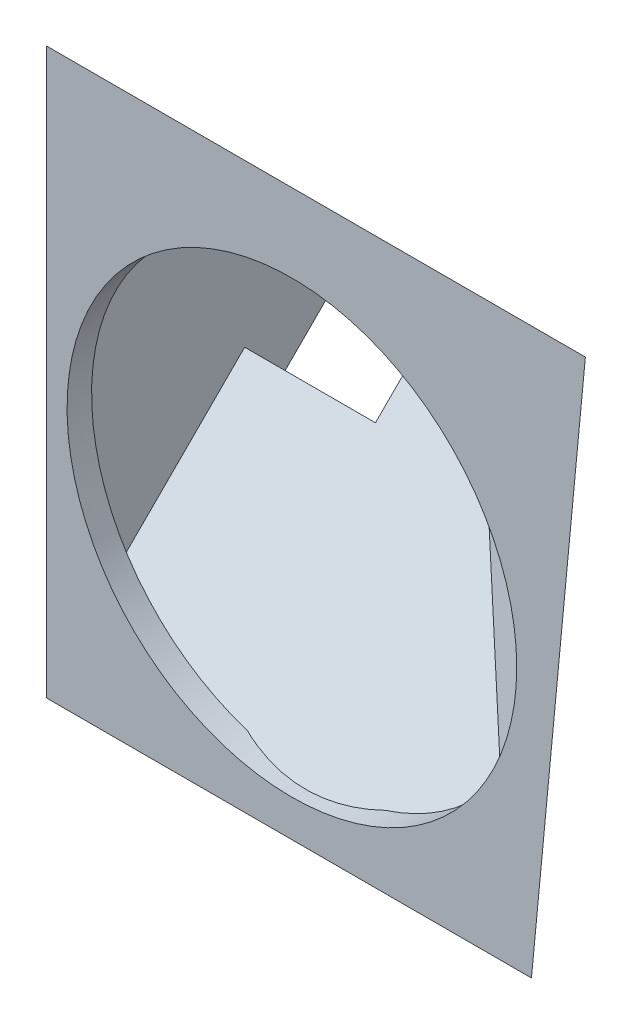
ISO-10303-21;
HEADER;
FILE_DESCRIPTION(('STEP AP214'),'2;1');
FILE_NAME('part.step','',(''),(''),'','','');
FILE_SCHEMA(('AUTOMOTIVE_DESIGN { 1 0 10303 214 1 1 1 1 }'));
ENDSEC;
DATA;
#1=APPLICATION_CONTEXT('core data for automotive mechanical design processes');
#2=APPLICATION_PROTOCOL_DEFINITION('international standard','automotive_design',2000,#1);
#3=PRODUCT_CONTEXT('',#1,'mechanical');
#4=PRODUCT('Part','Part','',(#3));
#5=PRODUCT_RELATED_PRODUCT_CATEGORY('part','',(#4));
#6=PRODUCT_DEFINITION_FORMATION('','',#4);
#7=PRODUCT_DEFINITION_CONTEXT('part definition',#1,'design');
#8=PRODUCT_DEFINITION('design','',#6,#7);
#9=PRODUCT_DEFINITION_SHAPE('','',#8);
#10=(LENGTH_UNIT() NAMED_UNIT(*) SI_UNIT(.MILLI.,.METRE.));
#11=(NAMED_UNIT(*) PLANE_ANGLE_UNIT() SI_UNIT($,.RADIAN.));
#12=(NAMED_UNIT(*) SI_UNIT($,.STERADIAN.) SOLID_ANGLE_UNIT());
#13=UNCERTAINTY_MEASURE_WITH_UNIT(LENGTH_MEASURE(1.E-05),#10,'distance_accuracy_value','');
#14=(GEOMETRIC_REPRESENTATION_CONTEXT(3) GLOBAL_UNCERTAINTY_ASSIGNED_CONTEXT((#13)) GLOBAL_UNIT_ASSIGNED_CONTEXT((#10,
#11,#12)) REPRESENTATION_CONTEXT('',''));
#15=CARTESIAN_POINT('',(0.,0.,0.));
#16=DIRECTION('',(0.,0.,1.));
#17=DIRECTION('',(1.,0.,0.));
#18=AXIS2_PLACEMENT_3D('',#15,#16,#17);
#19=CARTESIAN_POINT('',(-0.999999999999997,30.5355339059328,-32.5355339059329));
#20=DIRECTION('',(0.,-0.707106781186547,-0.707106781186547));
#21=DIRECTION('',(0.,0.707106781186548,-0.707106781186548));
#22=AXIS2_PLACEMENT_3D('',#19,#20,#21);
#23=PLANE('',#22);
#24=DIRECTION('',(-1.,0.,0.));
#25=VECTOR('',#24,1.);
#26=CARTESIAN_POINT('',(-2.,19.5753787975413,-21.5753787975413));
#27=LINE('',#26,#25);
#28=CARTESIAN_POINT('',(16.5,19.5753787975413,-21.5753787975413));
#29=VERTEX_POINT('',#28);
#30=CARTESIAN_POINT('',(-2.,19.5753787975413,-21.5753787975413));
#31=VERTEX_POINT('',#30);
#32=EDGE_CURVE('E262',#29,#31,#27,.T.);
#33=ORIENTED_EDGE('',*,*,#32,.F.);
#34=DIRECTION('',(0.,-0.707106781186548,0.707106781186548));
#35=VECTOR('',#34,1.);
#36=CARTESIAN_POINT('',(16.5,30.5355339059328,-32.5355339059329));
#37=LINE('',#36,#35);
#38=CARTESIAN_POINT('',(16.5,30.5355339059328,-32.5355339059329));
#39=VERTEX_POINT('',#38);
#40=EDGE_CURVE('E257',#39,#29,#37,.T.);
#41=ORIENTED_EDGE('',*,*,#40,.F.);
#42=DIRECTION('',(-1.,0.,0.));
#43=VECTOR('',#42,1.);
#44=CARTESIAN_POINT('',(-0.999999999999997,30.5355339059328,-32.5355339059329));
#45=LINE('',#44,#43);
#46=CARTESIAN_POINT('',(19.,30.5355339059329,-32.5355339059329));
#47=VERTEX_POINT('',#46);
#48=EDGE_CURVE('E420',#47,#39,#45,.T.);
#49=ORIENTED_EDGE('',*,*,#48,.F.);
#50=DIRECTION('',(0.,0.707106781186547,-0.707106781186548));
#51=VECTOR('',#50,1.);
#52=CARTESIAN_POINT('',(19.,30.5355339059329,-32.5355339059329));
#53=LINE('',#52,#51);
#54=CARTESIAN_POINT('',(19.,30.4660300272259,-32.4660300272259));
#55=VERTEX_POINT('',#54);
#56=EDGE_CURVE('E236',#55,#47,#53,.T.);
#57=ORIENTED_EDGE('',*,*,#56,.F.);
#58=DIRECTION('',(-0.920313974566673,-0.276606388408956,0.276606388408956));
#59=VECTOR('',#58,1.);
#60=CARTESIAN_POINT('',(50.9594752696427,40.0716594907398,-42.0716594907398));
#61=LINE('',#60,#59);
#62=CARTESIAN_POINT('',(19.0578126478103,30.4834059969026,-32.4834059969026));
#63=VERTEX_POINT('',#62);
#64=EDGE_CURVE('E359',#63,#55,#61,.T.);
#65=ORIENTED_EDGE('',*,*,#64,.F.);
#66=DIRECTION('',(-0.617093958453958,0.556414884074656,-0.556414884074656));
#67=VECTOR('',#66,1.);
#68=CARTESIAN_POINT('',(33.4208043364,17.5327325283206,-19.5327325283206));
#69=LINE('',#68,#67);
#70=CARTESIAN_POINT('',(57.3017599552091,-4.,2.));
#71=VERTEX_POINT('',#70);
#72=EDGE_CURVE('E361',#71,#63,#69,.T.);
#73=ORIENTED_EDGE('',*,*,#72,.F.);
#74=DIRECTION('',(1.,0.,0.));
#75=VECTOR('',#74,1.);
#76=CARTESIAN_POINT('',(0.,-4.,2.));
#77=LINE('',#76,#75);
#78=CARTESIAN_POINT('',(-1.99999999999999,-4.00000000000002,2.));
#79=VERTEX_POINT('',#78);
#80=EDGE_CURVE('E285',#79,#71,#77,.T.);
#81=ORIENTED_EDGE('',*,*,#80,.F.);
#82=DIRECTION('',(0.,-0.707106781186548,0.707106781186548));
#83=VECTOR('',#82,1.);
#84=CARTESIAN_POINT('',(-2.,30.5355339059328,-32.5355339059329));
#85=LINE('',#84,#83);
#86=EDGE_CURVE('E50',#31,#79,#85,.T.);
#87=ORIENTED_EDGE('',*,*,#86,.F.);
#88=EDGE_LOOP('',(#33,#41,#49,#57,#65,#73,#81,#87));
#89=FACE_BOUND('',#88,.T.);
#90=ADVANCED_FACE('F35',(#89),#23,.T.);
#91=CARTESIAN_POINT('',(-2.,58.,2.));
#92=DIRECTION('',(1.,0.,0.));
#93=DIRECTION('',(0.,1.,0.));
#94=AXIS2_PLACEMENT_3D('',#91,#92,#93);
#95=PLANE('',#94);
#96=DIRECTION('',(0.,-0.707106781186545,-0.70710678118655));
#97=VECTOR('',#96,1.);
#98=CARTESIAN_POINT('',(-2.,61.5355339059328,-1.53553390593273));
#99=LINE('',#98,#97);
#100=CARTESIAN_POINT('',(-2.,61.5355339059328,-1.53553390593273));
#101=VERTEX_POINT('',#100);
#102=CARTESIAN_POINT('',(-2.,27.0000000000001,-36.0710678118656));
#103=VERTEX_POINT('',#102);
#104=EDGE_CURVE('E416',#101,#103,#99,.T.);
#105=ORIENTED_EDGE('',*,*,#104,.T.);
#106=DIRECTION('',(0.,0.707106781186547,-0.707106781186547));
#107=VECTOR('',#106,1.);
#108=CARTESIAN_POINT('',(-2.,27.0000000000001,-36.0710678118656));
#109=LINE('',#108,#107);
#110=CARTESIAN_POINT('',(-2.,16.0398448916085,-25.110912703474));
#111=VERTEX_POINT('',#110);
#112=EDGE_CURVE('E258',#111,#103,#109,.T.);
#113=ORIENTED_EDGE('',*,*,#112,.F.);
#114=DIRECTION('',(0.,0.707106781186548,0.707106781186547));
#115=VECTOR('',#114,1.);
#116=CARTESIAN_POINT('',(-2.,16.0398448916085,-25.110912703474));
#117=LINE('',#116,#115);
#118=EDGE_CURVE('E268',#111,#31,#117,.T.);
#119=ORIENTED_EDGE('',*,*,#118,.T.);
#120=ORIENTED_EDGE('',*,*,#86,.T.);
#121=DIRECTION('',(0.,-1.,0.));
#122=VECTOR('',#121,1.);
#123=CARTESIAN_POINT('',(-1.99999999999999,0.,2.));
#124=LINE('',#123,#122);
#125=CARTESIAN_POINT('',(-2.,65.0710678118655,2.));
#126=VERTEX_POINT('',#125);
#127=EDGE_CURVE('E54',#126,#79,#124,.T.);
#128=ORIENTED_EDGE('',*,*,#127,.F.);
#129=DIRECTION('',(0.,0.707106781186545,0.70710678118655));
#130=VECTOR('',#129,1.);
#131=CARTESIAN_POINT('',(-2.,50.4320481590986,-12.639019652767));
#132=LINE('',#131,#130);
#133=CARTESIAN_POINT('',(-2.,62.0710678118655,-1.));
#134=VERTEX_POINT('',#133);
#135=EDGE_CURVE('E43',#134,#126,#132,.T.);
#136=ORIENTED_EDGE('',*,*,#135,.F.);
#137=DIRECTION('',(0.,-1.,0.));
#138=VECTOR('',#137,1.);
#139=CARTESIAN_POINT('',(-1.99999999999999,0.,-1.));
#140=LINE('',#139,#138);
#141=CARTESIAN_POINT('',(-2.,61.,-1.));
#142=VERTEX_POINT('',#141);
#143=EDGE_CURVE('E288',#134,#142,#140,.T.);
#144=ORIENTED_EDGE('',*,*,#143,.T.);
#145=DIRECTION('',(0.,0.70710678118655,-0.707106781186545));
#146=VECTOR('',#145,1.);
#147=CARTESIAN_POINT('',(-2.,58.,2.));
#148=LINE('',#147,#146);
#149=EDGE_CURVE('E412',#142,#101,#148,.T.);
#150=ORIENTED_EDGE('',*,*,#149,.T.);
#151=EDGE_LOOP('',(#105,#113,#119,#120,#128,#136,#144,#150));
#152=FACE_BOUND('',#151,.T.);
#153=ADVANCED_FACE('F37',(#152),#95,.F.);
#154=CARTESIAN_POINT('',(0.,0.,2.));
#155=DIRECTION('',(0.,0.,1.));
#156=DIRECTION('',(1.,0.,0.));
#157=AXIS2_PLACEMENT_3D('',#154,#155,#156);
#158=PLANE('',#157);
#159=ORIENTED_EDGE('',*,*,#127,.T.);
#160=ORIENTED_EDGE('',*,*,#80,.T.);
#161=DIRECTION('',(0.0950410018679323,0.995473358741428,0.));
#162=VECTOR('',#161,1.);
#163=CARTESIAN_POINT('',(57.1626082156239,-5.45749567930742,2.));
#164=LINE('',#163,#162);
#165=CARTESIAN_POINT('',(63.8961940777126,65.0710678118655,2.));
#166=VERTEX_POINT('',#165);
#167=EDGE_CURVE('E303',#71,#166,#164,.T.);
#168=ORIENTED_EDGE('',*,*,#167,.T.);
#169=DIRECTION('',(-1.,0.,0.));
#170=VECTOR('',#169,1.);
#171=CARTESIAN_POINT('',(0.,65.0710678118655,2.));
#172=LINE('',#171,#170);
#173=EDGE_CURVE('E294',#166,#126,#172,.T.);
#174=ORIENTED_EDGE('',*,*,#173,.T.);
#175=EDGE_LOOP('',(#159,#160,#168,#174));
#176=FACE_BOUND('',#175,.T.);
#177=CARTESIAN_POINT('',(28.,28.,2.));
#178=DIRECTION('',(0.,0.,1.));
#179=DIRECTION('',(1.,0.,0.));
#180=AXIS2_PLACEMENT_3D('',#177,#178,#179);
#181=CIRCLE('',#180,27.5);
#182=CARTESIAN_POINT('',(55.5,28.,2.));
#183=VERTEX_POINT('',#182);
#184=EDGE_CURVE('E423',#183,#183,#181,.T.);
#185=ORIENTED_EDGE('',*,*,#184,.F.);
#186=EDGE_LOOP('',(#185));
#187=FACE_BOUND('',#186,.T.);
#188=ADVANCED_FACE('F457',(#176,#187),#158,.T.);
#189=CARTESIAN_POINT('',(22.4693491883277,-2.14522009999242,-27.0649338448335));
#190=DIRECTION('',(0.637576713063338,-0.0608714728978925,-0.767978254084444));
#191=DIRECTION('',(-0.769405029139721,0.,-0.638761223881432));
#192=AXIS2_PLACEMENT_3D('',#189,#190,#191);
#193=PLANE('',#192);
#194=ORIENTED_EDGE('',*,*,#167,.F.);
#195=ORIENTED_EDGE('',*,*,#72,.T.);
#196=DIRECTION('',(0.676752968183959,0.520579206295352,0.520579206295355));
#197=VECTOR('',#196,1.);
#198=CARTESIAN_POINT('',(57.9982533790273,60.4375911747618,-2.52922081904323));
#199=LINE('',#198,#197);
#200=CARTESIAN_POINT('',(57.9982533790273,60.4375911747618,-2.52922081904323));
#201=VERTEX_POINT('',#200);
#202=EDGE_CURVE('E369',#63,#201,#199,.T.);
#203=ORIENTED_EDGE('',*,*,#202,.T.);
#204=DIRECTION('',(0.368105086916156,-0.851640742191297,0.37310412920029));
#205=VECTOR('',#204,1.);
#206=CARTESIAN_POINT('',(57.9982533790273,60.4375911747618,-2.52922081904323));
#207=LINE('',#206,#205);
#208=CARTESIAN_POINT('',(58.,60.4335502265806,-2.52745047812643));
#209=VERTEX_POINT('',#208);
#210=EDGE_CURVE('E366',#201,#209,#207,.T.);
#211=ORIENTED_EDGE('',*,*,#210,.T.);
#212=DIRECTION('',(0.,-0.996873493614738,0.0790141615683361));
#213=VECTOR('',#212,1.);
#214=CARTESIAN_POINT('',(58.,0.178221017418499,2.2485058974636));
#215=LINE('',#214,#213);
#216=CARTESIAN_POINT('',(58.,60.3617445062897,-2.52175901494585));
#217=VERTEX_POINT('',#216);
#218=EDGE_CURVE('E356',#209,#217,#215,.T.);
#219=ORIENTED_EDGE('',*,*,#218,.T.);
#220=DIRECTION('',(0.676638025521096,0.520845033743809,0.520462710713576));
#221=VECTOR('',#220,1.);
#222=CARTESIAN_POINT('',(11.0605112940198,24.2298709537277,-38.6271101923488));
#223=LINE('',#222,#221);
#224=CARTESIAN_POINT('',(59.9783934449024,61.8846213794527,-0.999999999999994));
#225=VERTEX_POINT('',#224);
#226=EDGE_CURVE('E305',#217,#225,#223,.T.);
#227=ORIENTED_EDGE('',*,*,#226,.T.);
#228=DIRECTION('',(0.0950410018679323,0.995473358741428,0.));
#229=VECTOR('',#228,1.);
#230=CARTESIAN_POINT('',(53.5816684606074,-5.11561199255989,-1.));
#231=LINE('',#230,#229);
#232=CARTESIAN_POINT('',(59.9961940777126,62.0710678118655,-1.));
#233=VERTEX_POINT('',#232);
#234=EDGE_CURVE('E300',#225,#233,#231,.T.);
#235=ORIENTED_EDGE('',*,*,#234,.T.);
#236=DIRECTION('',(0.676752968183959,0.520579206295352,0.520579206295355));
#237=VECTOR('',#236,1.);
#238=CARTESIAN_POINT('',(11.0027100271003,24.3837723883178,-38.687295423548));
#239=LINE('',#238,#237);
#240=EDGE_CURVE('E297',#233,#166,#239,.T.);
#241=ORIENTED_EDGE('',*,*,#240,.T.);
#242=EDGE_LOOP('',(#194,#195,#203,#211,#219,#227,#235,#241));
#243=FACE_BOUND('',#242,.T.);
#244=ADVANCED_FACE('F462',(#243),#193,.T.);
#245=CARTESIAN_POINT('',(0.,0.,-1.));
#246=DIRECTION('',(0.,0.,1.));
#247=DIRECTION('',(1.,0.,0.));
#248=AXIS2_PLACEMENT_3D('',#245,#246,#247);
#249=PLANE('',#248);
#250=ORIENTED_EDGE('',*,*,#143,.F.);
#251=DIRECTION('',(-1.,0.,0.));
#252=VECTOR('',#251,1.);
#253=CARTESIAN_POINT('',(0.,62.0710678118655,-1.));
#254=LINE('',#253,#252);
#255=EDGE_CURVE('E291',#233,#134,#254,.T.);
#256=ORIENTED_EDGE('',*,*,#255,.F.);
#257=ORIENTED_EDGE('',*,*,#234,.F.);
#258=DIRECTION('',(-0.917814014814735,-0.397010622288193,0.));
#259=VECTOR('',#258,1.);
#260=CARTESIAN_POINT('',(-13.0959962510217,30.2754843884852,-1.));
#261=LINE('',#260,#259);
#262=CARTESIAN_POINT('',(57.9333149147946,61.,-1.));
#263=VERTEX_POINT('',#262);
#264=EDGE_CURVE('E449',#225,#263,#261,.T.);
#265=ORIENTED_EDGE('',*,*,#264,.T.);
#266=DIRECTION('',(1.,0.,0.));
#267=VECTOR('',#266,1.);
#268=CARTESIAN_POINT('',(-1.,61.,-1.));
#269=LINE('',#268,#267);
#270=EDGE_CURVE('E342',#142,#263,#269,.T.);
#271=ORIENTED_EDGE('',*,*,#270,.F.);
#272=EDGE_LOOP('',(#250,#256,#257,#265,#271));
#273=FACE_BOUND('',#272,.T.);
#274=ADVANCED_FACE('F465',(#273),#249,.F.);
#275=CARTESIAN_POINT('',(19.590538607801,50.4320481590986,-12.639019652767));
#276=DIRECTION('',(0.,0.70710678118655,-0.707106781186545));
#277=DIRECTION('',(0.,0.707106781186545,0.70710678118655));
#278=AXIS2_PLACEMENT_3D('',#275,#276,#277);
#279=PLANE('',#278);
#280=ORIENTED_EDGE('',*,*,#255,.T.);
#281=ORIENTED_EDGE('',*,*,#135,.T.);
#282=ORIENTED_EDGE('',*,*,#173,.F.);
#283=ORIENTED_EDGE('',*,*,#240,.F.);
#284=EDGE_LOOP('',(#280,#281,#282,#283));
#285=FACE_BOUND('',#284,.T.);
#286=ADVANCED_FACE('F453',(#285),#279,.T.);
#287=CARTESIAN_POINT('',(63.7507449788584,58.,0.));
#288=DIRECTION('',(0.,0.707106781186545,0.70710678118655));
#289=DIRECTION('',(0.,-0.70710678118655,0.707106781186545));
#290=AXIS2_PLACEMENT_3D('',#287,#288,#289);
#291=PLANE('',#290);
#292=DIRECTION('',(-0.617093958453956,0.556414884074658,-0.556414884074655));
#293=VECTOR('',#292,1.);
#294=CARTESIAN_POINT('',(59.9887763891176,55.9138875009757,2.08611249902431));
#295=LINE('',#294,#293);
#296=CARTESIAN_POINT('',(56.566112055786,59.,-1.));
#297=VERTEX_POINT('',#296);
#298=CARTESIAN_POINT('',(56.4315612858642,59.1213203435597,-1.12132034355965));
#299=VERTEX_POINT('',#298);
#300=EDGE_CURVE('E320',#297,#299,#295,.T.);
#301=ORIENTED_EDGE('',*,*,#300,.F.);
#302=DIRECTION('',(1.,0.,0.));
#303=VECTOR('',#302,1.);
#304=CARTESIAN_POINT('',(63.7507449788584,59.,-1.));
#305=LINE('',#304,#303);
#306=CARTESIAN_POINT('',(-1.,59.,-1.));
#307=VERTEX_POINT('',#306);
#308=EDGE_CURVE('E343',#307,#297,#305,.T.);
#309=ORIENTED_EDGE('',*,*,#308,.F.);
#310=DIRECTION('',(0.,0.70710678118655,-0.707106781186545));
#311=VECTOR('',#310,1.);
#312=CARTESIAN_POINT('',(-1.,58.,0.));
#313=LINE('',#312,#311);
#314=CARTESIAN_POINT('',(-1.,59.1213203435597,-1.12132034355965));
#315=VERTEX_POINT('',#314);
#316=EDGE_CURVE('E404',#307,#315,#313,.T.);
#317=ORIENTED_EDGE('',*,*,#316,.T.);
#318=DIRECTION('',(-1.,0.,0.));
#319=VECTOR('',#318,1.);
#320=CARTESIAN_POINT('',(19.,59.1213203435596,-1.12132034355965));
#321=LINE('',#320,#319);
#322=EDGE_CURVE('E232',#299,#315,#321,.T.);
#323=ORIENTED_EDGE('',*,*,#322,.F.);
#324=EDGE_LOOP('',(#301,#309,#317,#323));
#325=FACE_BOUND('',#324,.T.);
#326=ADVANCED_FACE('F563',(#325),#291,.F.);
#327=CARTESIAN_POINT('',(0.,0.414213562373092,0.414213562373092));
#328=DIRECTION('',(0.,0.707106781186548,0.707106781186547));
#329=DIRECTION('',(0.,-0.707106781186547,0.707106781186548));
#330=AXIS2_PLACEMENT_3D('',#327,#328,#329);
#331=PLANE('',#330);
#332=DIRECTION('',(0.,0.707106781186547,-0.707106781186548));
#333=VECTOR('',#332,1.);
#334=CARTESIAN_POINT('',(15.,22.0502525316942,-21.221825406948));
#335=LINE('',#334,#333);
#336=CARTESIAN_POINT('',(15.,22.0502525316942,-21.221825406948));
#337=VERTEX_POINT('',#336);
#338=CARTESIAN_POINT('',(15.,30.5355339059327,-29.7071067811866));
#339=VERTEX_POINT('',#338);
#340=EDGE_CURVE('E277',#337,#339,#335,.T.);
#341=ORIENTED_EDGE('',*,*,#340,.F.);
#342=DIRECTION('',(1.,0.,0.));
#343=VECTOR('',#342,1.);
#344=CARTESIAN_POINT('',(-2.,22.0502525316942,-21.221825406948));
#345=LINE('',#344,#343);
#346=CARTESIAN_POINT('',(-0.999999999999996,22.0502525316942,-21.221825406948));
#347=VERTEX_POINT('',#346);
#348=EDGE_CURVE('E374',#347,#337,#345,.T.);
#349=ORIENTED_EDGE('',*,*,#348,.F.);
#350=DIRECTION('',(0.,0.707106781186547,-0.707106781186548));
#351=VECTOR('',#350,1.);
#352=CARTESIAN_POINT('',(-0.999999999999994,0.414213562373092,0.414213562373092));
#353=LINE('',#352,#351);
#354=CARTESIAN_POINT('',(-1.,1.82842712474618,-1.));
#355=VERTEX_POINT('',#354);
#356=EDGE_CURVE('E378',#355,#347,#353,.T.);
#357=ORIENTED_EDGE('',*,*,#356,.F.);
#358=DIRECTION('',(1.,0.,0.));
#359=VECTOR('',#358,1.);
#360=CARTESIAN_POINT('',(0.,1.82842712474618,-1.));
#361=LINE('',#360,#359);
#362=CARTESIAN_POINT('',(19.5561399090653,1.82842712474619,-0.999999999999999));
#363=VERTEX_POINT('',#362);
#364=EDGE_CURVE('E353',#355,#363,#361,.T.);
#365=ORIENTED_EDGE('',*,*,#364,.T.);
#366=CARTESIAN_POINT('',(28.,28.,-27.1715728752538));
#367=DIRECTION('',(0.,-0.707106781186548,-0.707106781186547));
#368=DIRECTION('',(0.,0.707106781186547,-0.707106781186548));
#369=AXIS2_PLACEMENT_3D('',#366,#367,#368);
#370=ELLIPSE('',#369,38.8908729652601,27.5);
#371=CARTESIAN_POINT('',(36.4438600909347,1.82842712474619,-0.999999999999999));
#372=VERTEX_POINT('',#371);
#373=EDGE_CURVE('E363',#372,#363,#370,.T.);
#374=ORIENTED_EDGE('',*,*,#373,.F.);
#375=CARTESIAN_POINT('',(51.1077604919638,1.82842712474619,-1.));
#376=VERTEX_POINT('',#375);
#377=EDGE_CURVE('E350',#372,#376,#361,.T.);
#378=ORIENTED_EDGE('',*,*,#377,.T.);
#379=DIRECTION('',(-0.617093958453958,0.556414884074656,-0.556414884074656));
#380=VECTOR('',#379,1.);
#381=CARTESIAN_POINT('',(32.6168416136838,18.5011271943899,-17.6727000696438));
#382=LINE('',#381,#380);
#383=CARTESIAN_POINT('',(19.2700389169493,30.5355339059327,-29.7071067811866));
#384=VERTEX_POINT('',#383);
#385=EDGE_CURVE('E314',#376,#384,#382,.T.);
#386=ORIENTED_EDGE('',*,*,#385,.T.);
#387=DIRECTION('',(1.,0.,0.));
#388=VECTOR('',#387,1.);
#389=CARTESIAN_POINT('',(19.,30.5355339059327,-29.7071067811866));
#390=LINE('',#389,#388);
#391=EDGE_CURVE('E280',#339,#384,#390,.T.);
#392=ORIENTED_EDGE('',*,*,#391,.F.);
#393=EDGE_LOOP('',(#341,#349,#357,#365,#374,#378,#386,#392));
#394=FACE_BOUND('',#393,.T.);
#395=ADVANCED_FACE('F542',(#394),#331,.T.);
#396=CARTESIAN_POINT('',(28.,28.,2.));
#397=DIRECTION('',(0.,0.,-1.));
#398=DIRECTION('',(-1.,0.,0.));
#399=AXIS2_PLACEMENT_3D('',#396,#397,#398);
#400=CYLINDRICAL_SURFACE('',#399,27.5);
#401=ORIENTED_EDGE('',*,*,#184,.T.);
#402=EDGE_LOOP('',(#401));
#403=FACE_BOUND('',#402,.T.);
#404=CARTESIAN_POINT('',(28.,28.,-1.));
#405=DIRECTION('',(0.,0.,1.));
#406=DIRECTION('',(1.,0.,0.));
#407=AXIS2_PLACEMENT_3D('',#404,#405,#406);
#408=CIRCLE('',#407,27.5);
#409=CARTESIAN_POINT('',(54.3558786367094,35.8496917956722,-1.));
#410=VERTEX_POINT('',#409);
#411=EDGE_CURVE('E340',#410,#363,#408,.T.);
#412=ORIENTED_EDGE('',*,*,#411,.F.);
#413=CARTESIAN_POINT('',(28.,28.,-22.2585084054961));
#414=DIRECTION('',(0.637576713063338,-0.0608714728978925,-0.767978254084444));
#415=DIRECTION('',(-0.76450189203382,0.072989422680971,-0.640475917777873));
#416=AXIS2_PLACEMENT_3D('',#413,#414,#415);
#417=ELLIPSE('',#416,35.8083055786319,27.5);
#418=CARTESIAN_POINT('',(55.4967719131796,28.4213482580712,0.535956508168884));
#419=VERTEX_POINT('',#418);
#420=EDGE_CURVE('E315',#410,#419,#417,.T.);
#421=ORIENTED_EDGE('',*,*,#420,.T.);
#422=CARTESIAN_POINT('',(28.,28.,33.3093670357194));
#423=DIRECTION('',(-0.764501892033819,0.0729894226809714,-0.640475917777873));
#424=DIRECTION('',(0.637576713063338,-0.0608714728978928,-0.767978254084444));
#425=AXIS2_PLACEMENT_3D('',#422,#423,#424);
#426=ELLIPSE('',#425,42.9368212553738,27.5);
#427=CARTESIAN_POINT('',(54.9202984892681,22.383281273848,0.535956508168883));
#428=VERTEX_POINT('',#427);
#429=EDGE_CURVE('E337',#419,#428,#426,.T.);
#430=ORIENTED_EDGE('',*,*,#429,.T.);
#431=CARTESIAN_POINT('',(52.3944132843527,15.3050167187115,-1.));
#432=VERTEX_POINT('',#431);
#433=EDGE_CURVE('E309',#428,#432,#417,.T.);
#434=ORIENTED_EDGE('',*,*,#433,.T.);
#435=EDGE_CURVE('E339',#372,#432,#408,.T.);
#436=ORIENTED_EDGE('',*,*,#435,.F.);
#437=ORIENTED_EDGE('',*,*,#373,.T.);
#438=EDGE_LOOP('',(#412,#421,#430,#434,#436,#437));
#439=FACE_BOUND('',#438,.T.);
#440=ADVANCED_FACE('F538',(#403,#439),#400,.F.);
#441=DIRECTION('',(0.0950410018679323,0.995473358741428,0.));
#442=VECTOR('',#441,1.);
#443=CARTESIAN_POINT('',(50.473125793788,-4.81882955553188,-1.));
#444=LINE('',#443,#442);
#445=EDGE_CURVE('E317',#410,#297,#444,.T.);
#446=ORIENTED_EDGE('',*,*,#445,.F.);
#447=ORIENTED_EDGE('',*,*,#411,.T.);
#448=ORIENTED_EDGE('',*,*,#364,.F.);
#449=DIRECTION('',(0.,1.,0.));
#450=VECTOR('',#449,1.);
#451=CARTESIAN_POINT('',(-0.999999999999994,0.,-1.));
#452=LINE('',#451,#450);
#453=EDGE_CURVE('E347',#355,#307,#452,.T.);
#454=ORIENTED_EDGE('',*,*,#453,.T.);
#455=ORIENTED_EDGE('',*,*,#308,.T.);
#456=EDGE_LOOP('',(#446,#447,#448,#454,#455));
#457=FACE_BOUND('',#456,.T.);
#458=ADVANCED_FACE('F541',(#457),#249,.F.);
#459=DIRECTION('',(0.0950410018679323,0.995473358741428,0.));
#460=VECTOR('',#459,1.);
#461=CARTESIAN_POINT('',(50.473125793788,-4.81882955553188,-1.));
#462=LINE('',#461,#460);
#463=EDGE_CURVE('E446',#376,#432,#462,.T.);
#464=ORIENTED_EDGE('',*,*,#463,.F.);
#465=ORIENTED_EDGE('',*,*,#377,.F.);
#466=ORIENTED_EDGE('',*,*,#435,.T.);
#467=EDGE_LOOP('',(#464,#465,#466));
#468=FACE_BOUND('',#467,.T.);
#469=ADVANCED_FACE('F552',(#468),#249,.F.);
#470=CARTESIAN_POINT('',(57.0418883094323,60.5288983841087,-1.37725343791657));
#471=DIRECTION('',(0.676752968183959,0.520579206295352,0.520579206295355));
#472=DIRECTION('',(0.609710760849694,0.,-0.792623989104599));
#473=AXIS2_PLACEMENT_3D('',#470,#471,#472);
#474=PLANE('',#473);
#475=DIRECTION('',(-0.637576713063338,0.0608714728978925,0.767978254084444));
#476=VECTOR('',#475,1.);
#477=CARTESIAN_POINT('',(57.0669232611796,60.4709780085296,-1.35187849960893));
#478=LINE('',#477,#476);
#479=CARTESIAN_POINT('',(58.,60.3818942100548,-2.4757944616007));
#480=VERTEX_POINT('',#479);
#481=CARTESIAN_POINT('',(57.9669186105665,60.3850525953268,-2.43594704060915));
#482=VERTEX_POINT('',#481);
#483=EDGE_CURVE('E333',#480,#482,#478,.T.);
#484=ORIENTED_EDGE('',*,*,#483,.F.);
#485=DIRECTION('',(0.,0.70710678118655,-0.707106781186545));
#486=VECTOR('',#485,1.);
#487=CARTESIAN_POINT('',(58.,59.9061257852397,-2.00002603678555));
#488=LINE('',#487,#486);
#489=EDGE_CURVE('E346',#480,#209,#488,.T.);
#490=ORIENTED_EDGE('',*,*,#489,.T.);
#491=ORIENTED_EDGE('',*,*,#210,.F.);
#492=DIRECTION('',(0.637576713063338,-0.0608714728978924,-0.767978254084444));
#493=VECTOR('',#492,1.);
#494=CARTESIAN_POINT('',(57.0418883094323,60.5288983841087,-1.37725343791657));
#495=LINE('',#494,#493);
#496=CARTESIAN_POINT('',(57.9669186105665,60.4405828045846,-2.49147724986692));
#497=VERTEX_POINT('',#496);
#498=EDGE_CURVE('E371',#497,#201,#495,.T.);
#499=ORIENTED_EDGE('',*,*,#498,.F.);
#500=DIRECTION('',(0.,-0.70710678118655,0.707106781186545));
#501=VECTOR('',#500,1.);
#502=CARTESIAN_POINT('',(57.9669186105665,18.3466399992999,39.6024655554175));
#503=LINE('',#502,#501);
#504=EDGE_CURVE('E443',#497,#482,#503,.T.);
#505=ORIENTED_EDGE('',*,*,#504,.T.);
#506=EDGE_LOOP('',(#484,#490,#491,#499,#505));
#507=FACE_BOUND('',#506,.T.);
#508=ADVANCED_FACE('F500',(#507),#474,.T.);
#509=CARTESIAN_POINT('',(58.,58.,2.));
#510=DIRECTION('',(-1.,0.,0.));
#511=DIRECTION('',(0.,-1.,0.));
#512=AXIS2_PLACEMENT_3D('',#509,#510,#511);
#513=PLANE('',#512);
#514=DIRECTION('',(0.,0.70710678118655,-0.707106781186545));
#515=VECTOR('',#514,1.);
#516=CARTESIAN_POINT('',(58.,61.5355339059328,-1.53553390593273));
#517=LINE('',#516,#515);
#518=CARTESIAN_POINT('',(58.,61.0200541414602,-1.02005414146018));
#519=VERTEX_POINT('',#518);
#520=CARTESIAN_POINT('',(58.,61.5355339059328,-1.53553390593273));
#521=VERTEX_POINT('',#520);
#522=EDGE_CURVE('E409',#519,#521,#517,.T.);
#523=ORIENTED_EDGE('',*,*,#522,.F.);
#524=DIRECTION('',(0.,-0.401491237528223,-0.915862864291405));
#525=VECTOR('',#524,1.);
#526=CARTESIAN_POINT('',(58.,61.643742739477,0.402674855870512));
#527=LINE('',#526,#525);
#528=CARTESIAN_POINT('',(58.,60.4105122772437,-2.41051227724364));
#529=VERTEX_POINT('',#528);
#530=EDGE_CURVE('E328',#519,#529,#527,.T.);
#531=ORIENTED_EDGE('',*,*,#530,.T.);
#532=DIRECTION('',(0.,-0.70710678118655,0.707106781186545));
#533=VECTOR('',#532,1.);
#534=CARTESIAN_POINT('',(58.,58.,0.));
#535=LINE('',#534,#533);
#536=CARTESIAN_POINT('',(58.,60.5355339059328,-2.53553390593274));
#537=VERTEX_POINT('',#536);
#538=EDGE_CURVE('E408',#537,#529,#535,.T.);
#539=ORIENTED_EDGE('',*,*,#538,.F.);
#540=DIRECTION('',(0.,-0.707106781186545,-0.70710678118655));
#541=VECTOR('',#540,1.);
#542=CARTESIAN_POINT('',(58.,60.5355339059328,-2.53553390593274));
#543=LINE('',#542,#541);
#544=EDGE_CURVE('E405',#521,#537,#543,.T.);
#545=ORIENTED_EDGE('',*,*,#544,.F.);
#546=EDGE_LOOP('',(#523,#531,#539,#545));
#547=FACE_BOUND('',#546,.T.);
#548=ADVANCED_FACE('F510',(#547),#513,.F.);
#549=CARTESIAN_POINT('',(-0.999999999999994,0.,0.));
#550=DIRECTION('',(-1.,0.,0.));
#551=DIRECTION('',(0.,-1.,0.));
#552=AXIS2_PLACEMENT_3D('',#549,#550,#551);
#553=PLANE('',#552);
#554=ORIENTED_EDGE('',*,*,#453,.F.);
#555=ORIENTED_EDGE('',*,*,#356,.T.);
#556=DIRECTION('',(0.,-0.707106781186548,-0.707106781186547));
#557=VECTOR('',#556,1.);
#558=CARTESIAN_POINT('',(-0.999999999999996,21.6360389693211,-21.6360389693211));
#559=LINE('',#558,#557);
#560=CARTESIAN_POINT('',(-0.999999999999996,17.1005050633883,-26.1715728752538));
#561=VERTEX_POINT('',#560);
#562=EDGE_CURVE('E244',#347,#561,#559,.T.);
#563=ORIENTED_EDGE('',*,*,#562,.T.);
#564=DIRECTION('',(0.,0.707106781186547,-0.707106781186548));
#565=VECTOR('',#564,1.);
#566=CARTESIAN_POINT('',(-0.999999999999996,25.5857864376269,-34.6568542494924));
#567=LINE('',#566,#565);
#568=CARTESIAN_POINT('',(-0.999999999999996,25.5857864376269,-34.6568542494924));
#569=VERTEX_POINT('',#568);
#570=EDGE_CURVE('E240',#561,#569,#567,.T.);
#571=ORIENTED_EDGE('',*,*,#570,.T.);
#572=DIRECTION('',(0.,-0.707106781186547,-0.707106781186548));
#573=VECTOR('',#572,1.);
#574=CARTESIAN_POINT('',(-0.999999999999997,29.1213203435597,-31.1213203435597));
#575=LINE('',#574,#573);
#576=EDGE_CURVE('E224',#315,#569,#575,.T.);
#577=ORIENTED_EDGE('',*,*,#576,.F.);
#578=ORIENTED_EDGE('',*,*,#316,.F.);
#579=EDGE_LOOP('',(#554,#555,#563,#571,#577,#578));
#580=FACE_BOUND('',#579,.T.);
#581=ADVANCED_FACE('F242',(#580),#553,.F.);
#582=CARTESIAN_POINT('',(-1.,58.,2.));
#583=DIRECTION('',(0.,0.707106781186545,0.70710678118655));
#584=DIRECTION('',(0.,-0.70710678118655,0.707106781186545));
#585=AXIS2_PLACEMENT_3D('',#582,#583,#584);
#586=PLANE('',#585);
#587=DIRECTION('',(-0.920233139275103,-0.276740825846034,0.276740825846032));
#588=VECTOR('',#587,1.);
#589=CARTESIAN_POINT('',(6.49887650066604,45.5321708639341,14.4678291360659));
#590=LINE('',#589,#588);
#591=EDGE_CURVE('E326',#519,#263,#590,.T.);
#592=ORIENTED_EDGE('',*,*,#591,.F.);
#593=ORIENTED_EDGE('',*,*,#522,.T.);
#594=DIRECTION('',(-1.,0.,0.));
#595=VECTOR('',#594,1.);
#596=CARTESIAN_POINT('',(-1.,61.5355339059328,-1.53553390593273));
#597=LINE('',#596,#595);
#598=EDGE_CURVE('E419',#521,#101,#597,.T.);
#599=ORIENTED_EDGE('',*,*,#598,.T.);
#600=ORIENTED_EDGE('',*,*,#149,.F.);
#601=ORIENTED_EDGE('',*,*,#270,.T.);
#602=EDGE_LOOP('',(#592,#593,#599,#600,#601));
#603=FACE_BOUND('',#602,.T.);
#604=ADVANCED_FACE('F474',(#603),#586,.T.);
#605=CARTESIAN_POINT('',(58.,56.9338709147473,1.23010615733676));
#606=DIRECTION('',(1.,0.,0.));
#607=DIRECTION('',(0.,1.,0.));
#608=AXIS2_PLACEMENT_3D('',#605,#606,#607);
#609=PLANE('',#608);
#610=DIRECTION('',(0.,0.401491237528223,0.915862864291405));
#611=VECTOR('',#610,1.);
#612=CARTESIAN_POINT('',(58.,61.1887894644513,-0.635143085435138));
#613=LINE('',#612,#611);
#614=EDGE_CURVE('E335',#217,#480,#613,.T.);
#615=ORIENTED_EDGE('',*,*,#614,.F.);
#616=ORIENTED_EDGE('',*,*,#218,.F.);
#617=ORIENTED_EDGE('',*,*,#489,.F.);
#618=EDGE_LOOP('',(#615,#616,#617));
#619=FACE_BOUND('',#618,.T.);
#620=ADVANCED_FACE('F504',(#619),#609,.T.);
#621=CARTESIAN_POINT('',(57.0418883094323,60.5288983841087,-1.37725343791657));
#622=DIRECTION('',(-0.368105086916156,0.851640742191297,-0.37310412920029));
#623=DIRECTION('',(0.,0.401280353152308,0.915955281754496));
#624=AXIS2_PLACEMENT_3D('',#621,#622,#623);
#625=PLANE('',#624);
#626=ORIENTED_EDGE('',*,*,#202,.F.);
#627=ORIENTED_EDGE('',*,*,#64,.T.);
#628=DIRECTION('',(0.67675296818396,0.520579206295352,0.520579206295355));
#629=VECTOR('',#628,1.);
#630=CARTESIAN_POINT('',(19.,30.4660300272259,-32.4660300272259));
#631=LINE('',#630,#629);
#632=EDGE_CURVE('E440',#55,#497,#631,.T.);
#633=ORIENTED_EDGE('',*,*,#632,.T.);
#634=ORIENTED_EDGE('',*,*,#498,.T.);
#635=EDGE_LOOP('',(#626,#627,#633,#634));
#636=FACE_BOUND('',#635,.T.);
#637=ADVANCED_FACE('F494',(#636),#625,.T.);
#638=CARTESIAN_POINT('',(-1.,61.5355339059328,-1.53553390593273));
#639=DIRECTION('',(0.,0.70710678118655,-0.707106781186545));
#640=DIRECTION('',(0.,0.707106781186545,0.70710678118655));
#641=AXIS2_PLACEMENT_3D('',#638,#639,#640);
#642=PLANE('',#641);
#643=ORIENTED_EDGE('',*,*,#48,.T.);
#644=DIRECTION('',(0.,0.707106781186548,0.707106781186547));
#645=VECTOR('',#644,1.);
#646=CARTESIAN_POINT('',(16.5,27.0000000000001,-36.0710678118656));
#647=LINE('',#646,#645);
#648=CARTESIAN_POINT('',(16.5,27.0000000000001,-36.0710678118656));
#649=VERTEX_POINT('',#648);
#650=EDGE_CURVE('E275',#649,#39,#647,.T.);
#651=ORIENTED_EDGE('',*,*,#650,.F.);
#652=DIRECTION('',(1.,0.,0.));
#653=VECTOR('',#652,1.);
#654=CARTESIAN_POINT('',(-2.,27.0000000000001,-36.0710678118656));
#655=LINE('',#654,#653);
#656=EDGE_CURVE('E261',#103,#649,#655,.T.);
#657=ORIENTED_EDGE('',*,*,#656,.F.);
#658=ORIENTED_EDGE('',*,*,#104,.F.);
#659=ORIENTED_EDGE('',*,*,#598,.F.);
#660=ORIENTED_EDGE('',*,*,#544,.T.);
#661=DIRECTION('',(-0.67675296818396,-0.520579206295352,-0.520579206295355));
#662=VECTOR('',#661,1.);
#663=CARTESIAN_POINT('',(19.,30.5355339059329,-32.5355339059329));
#664=LINE('',#663,#662);
#665=EDGE_CURVE('E380',#537,#47,#664,.T.);
#666=ORIENTED_EDGE('',*,*,#665,.T.);
#667=EDGE_LOOP('',(#643,#651,#657,#658,#659,#660,#666));
#668=FACE_BOUND('',#667,.T.);
#669=DIRECTION('',(0.,0.707106781186545,0.70710678118655));
#670=VECTOR('',#669,1.);
#671=CARTESIAN_POINT('',(0.499999999999999,32.4326459990917,-30.638421812774));
#672=LINE('',#671,#670);
#673=CARTESIAN_POINT('',(0.499999999999999,32.4326459990917,-30.638421812774));
#674=VERTEX_POINT('',#673);
#675=CARTESIAN_POINT('',(0.500000000000001,42.9319377173932,-20.1391300944724));
#676=VERTEX_POINT('',#675);
#677=EDGE_CURVE('E383',#674,#676,#672,.T.);
#678=ORIENTED_EDGE('',*,*,#677,.F.);
#679=DIRECTION('',(-1.,0.,0.));
#680=VECTOR('',#679,1.);
#681=CARTESIAN_POINT('',(0.499999999999999,32.4326459990917,-30.638421812774));
#682=LINE('',#681,#680);
#683=CARTESIAN_POINT('',(4.5,32.4326459990917,-30.638421812774));
#684=VERTEX_POINT('',#683);
#685=EDGE_CURVE('E391',#684,#674,#682,.T.);
#686=ORIENTED_EDGE('',*,*,#685,.F.);
#687=DIRECTION('',(0.,-0.707106781186545,-0.70710678118655));
#688=VECTOR('',#687,1.);
#689=CARTESIAN_POINT('',(4.5,32.4326459990917,-30.638421812774));
#690=LINE('',#689,#688);
#691=CARTESIAN_POINT('',(4.5,42.9319377173932,-20.1391300944724));
#692=VERTEX_POINT('',#691);
#693=EDGE_CURVE('E388',#692,#684,#690,.T.);
#694=ORIENTED_EDGE('',*,*,#693,.F.);
#695=DIRECTION('',(1.,0.,0.));
#696=VECTOR('',#695,1.);
#697=CARTESIAN_POINT('',(0.500000000000001,42.9319377173932,-20.1391300944724));
#698=LINE('',#697,#696);
#699=EDGE_CURVE('E385',#676,#692,#698,.T.);
#700=ORIENTED_EDGE('',*,*,#699,.F.);
#701=EDGE_LOOP('',(#678,#686,#694,#700));
#702=FACE_BOUND('',#701,.T.);
#703=ADVANCED_FACE('F478',(#668,#702),#642,.T.);
#704=CARTESIAN_POINT('',(19.,29.1213203435597,-31.1213203435597));
#705=DIRECTION('',(0.,0.707106781186548,-0.707106781186547));
#706=DIRECTION('',(0.,0.707106781186547,0.707106781186548));
#707=AXIS2_PLACEMENT_3D('',#704,#705,#706);
#708=PLANE('',#707);
#709=DIRECTION('',(-1.,0.,0.));
#710=VECTOR('',#709,1.);
#711=CARTESIAN_POINT('',(19.,31.0184324367185,-29.2242082504008));
#712=LINE('',#711,#710);
#713=CARTESIAN_POINT('',(4.5,31.0184324367185,-29.2242082504008));
#714=VERTEX_POINT('',#713);
#715=CARTESIAN_POINT('',(0.499999999999999,31.0184324367185,-29.2242082504008));
#716=VERTEX_POINT('',#715);
#717=EDGE_CURVE('E434',#714,#716,#712,.T.);
#718=ORIENTED_EDGE('',*,*,#717,.T.);
#719=DIRECTION('',(0.,0.707106781186547,0.707106781186548));
#720=VECTOR('',#719,1.);
#721=CARTESIAN_POINT('',(0.499999999999997,29.1213203435597,-31.1213203435596));
#722=LINE('',#721,#720);
#723=CARTESIAN_POINT('',(0.500000000000001,41.51772415502,-18.7249165320993));
#724=VERTEX_POINT('',#723);
#725=EDGE_CURVE('E437',#716,#724,#722,.T.);
#726=ORIENTED_EDGE('',*,*,#725,.T.);
#727=DIRECTION('',(1.,0.,0.));
#728=VECTOR('',#727,1.);
#729=CARTESIAN_POINT('',(19.,41.51772415502,-18.7249165320993));
#730=LINE('',#729,#728);
#731=CARTESIAN_POINT('',(4.5,41.51772415502,-18.7249165320993));
#732=VERTEX_POINT('',#731);
#733=EDGE_CURVE('E428',#724,#732,#730,.T.);
#734=ORIENTED_EDGE('',*,*,#733,.T.);
#735=DIRECTION('',(0.,-0.707106781186547,-0.707106781186548));
#736=VECTOR('',#735,1.);
#737=CARTESIAN_POINT('',(4.5,29.1213203435597,-31.1213203435596));
#738=LINE('',#737,#736);
#739=EDGE_CURVE('E431',#732,#714,#738,.T.);
#740=ORIENTED_EDGE('',*,*,#739,.T.);
#741=EDGE_LOOP('',(#718,#726,#734,#740));
#742=FACE_BOUND('',#741,.T.);
#743=DIRECTION('',(0.,0.707106781186547,0.707106781186548));
#744=VECTOR('',#743,1.);
#745=CARTESIAN_POINT('',(15.,29.1213203435597,-31.1213203435597));
#746=LINE('',#745,#744);
#747=CARTESIAN_POINT('',(15.,25.5857864376269,-34.6568542494924));
#748=VERTEX_POINT('',#747);
#749=EDGE_CURVE('E283',#748,#339,#746,.T.);
#750=ORIENTED_EDGE('',*,*,#749,.T.);
#751=ORIENTED_EDGE('',*,*,#391,.T.);
#752=DIRECTION('',(-0.676752968183959,-0.520579206295354,-0.520579206295354));
#753=VECTOR('',#752,1.);
#754=CARTESIAN_POINT('',(18.1498977159156,29.6738868282145,-30.5687538589048));
#755=LINE('',#754,#753);
#756=EDGE_CURVE('E323',#299,#384,#755,.T.);
#757=ORIENTED_EDGE('',*,*,#756,.F.);
#758=ORIENTED_EDGE('',*,*,#322,.T.);
#759=ORIENTED_EDGE('',*,*,#576,.T.);
#760=DIRECTION('',(1.,0.,0.));
#761=VECTOR('',#760,1.);
#762=CARTESIAN_POINT('',(-0.999999999999996,25.5857864376269,-34.6568542494924));
#763=LINE('',#762,#761);
#764=EDGE_CURVE('E229',#569,#748,#763,.T.);
#765=ORIENTED_EDGE('',*,*,#764,.T.);
#766=EDGE_LOOP('',(#750,#751,#757,#758,#759,#765));
#767=FACE_BOUND('',#766,.T.);
#768=ADVANCED_FACE('F227',(#742,#767),#708,.F.);
#769=CARTESIAN_POINT('',(0.500000000000001,18.2905103753607,-16.4962861890431));
#770=DIRECTION('',(-1.,0.,0.));
#771=DIRECTION('',(0.,0.,1.));
#772=AXIS2_PLACEMENT_3D('',#769,#770,#771);
#773=PLANE('',#772);
#774=DIRECTION('',(0.,0.70710678118655,-0.707106781186545));
#775=VECTOR('',#774,1.);
#776=CARTESIAN_POINT('',(0.500000000000001,18.2905103753607,-16.4962861890431));
#777=LINE('',#776,#775);
#778=EDGE_CURVE('E237',#716,#674,#777,.T.);
#779=ORIENTED_EDGE('',*,*,#778,.T.);
#780=ORIENTED_EDGE('',*,*,#677,.T.);
#781=DIRECTION('',(0.,0.70710678118655,-0.707106781186545));
#782=VECTOR('',#781,1.);
#783=CARTESIAN_POINT('',(0.500000000000003,28.7898020936622,-5.99699447074154));
#784=LINE('',#783,#782);
#785=EDGE_CURVE('E394',#724,#676,#784,.T.);
#786=ORIENTED_EDGE('',*,*,#785,.F.);
#787=ORIENTED_EDGE('',*,*,#725,.F.);
#788=EDGE_LOOP('',(#779,#780,#786,#787));
#789=FACE_BOUND('',#788,.T.);
#790=ADVANCED_FACE('F577',(#789),#773,.F.);
#791=CARTESIAN_POINT('',(0.500000000000001,18.2905103753607,-16.4962861890431));
#792=DIRECTION('',(0.,-0.707106781186545,-0.70710678118655));
#793=DIRECTION('',(0.,0.70710678118655,-0.707106781186545));
#794=AXIS2_PLACEMENT_3D('',#791,#792,#793);
#795=PLANE('',#794);
#796=DIRECTION('',(0.,0.70710678118655,-0.707106781186545));
#797=VECTOR('',#796,1.);
#798=CARTESIAN_POINT('',(4.5,18.2905103753607,-16.4962861890431));
#799=LINE('',#798,#797);
#800=EDGE_CURVE('E396',#714,#684,#799,.T.);
#801=ORIENTED_EDGE('',*,*,#800,.T.);
#802=ORIENTED_EDGE('',*,*,#685,.T.);
#803=ORIENTED_EDGE('',*,*,#778,.F.);
#804=ORIENTED_EDGE('',*,*,#717,.F.);
#805=EDGE_LOOP('',(#801,#802,#803,#804));
#806=FACE_BOUND('',#805,.T.);
#807=ADVANCED_FACE('F573',(#806),#795,.F.);
#808=CARTESIAN_POINT('',(4.5,18.2905103753607,-16.4962861890431));
#809=DIRECTION('',(1.,0.,0.));
#810=DIRECTION('',(0.,0.,-1.));
#811=AXIS2_PLACEMENT_3D('',#808,#809,#810);
#812=PLANE('',#811);
#813=DIRECTION('',(0.,0.70710678118655,-0.707106781186545));
#814=VECTOR('',#813,1.);
#815=CARTESIAN_POINT('',(4.5,28.7898020936622,-5.99699447074154));
#816=LINE('',#815,#814);
#817=EDGE_CURVE('E398',#732,#692,#816,.T.);
#818=ORIENTED_EDGE('',*,*,#817,.T.);
#819=ORIENTED_EDGE('',*,*,#693,.T.);
#820=ORIENTED_EDGE('',*,*,#800,.F.);
#821=ORIENTED_EDGE('',*,*,#739,.F.);
#822=EDGE_LOOP('',(#818,#819,#820,#821));
#823=FACE_BOUND('',#822,.T.);
#824=ADVANCED_FACE('F576',(#823),#812,.F.);
#825=CARTESIAN_POINT('',(0.500000000000003,28.7898020936622,-5.99699447074154));
#826=DIRECTION('',(0.,0.707106781186545,0.70710678118655));
#827=DIRECTION('',(0.,-0.70710678118655,0.707106781186545));
#828=AXIS2_PLACEMENT_3D('',#825,#826,#827);
#829=PLANE('',#828);
#830=ORIENTED_EDGE('',*,*,#785,.T.);
#831=ORIENTED_EDGE('',*,*,#699,.T.);
#832=ORIENTED_EDGE('',*,*,#817,.F.);
#833=ORIENTED_EDGE('',*,*,#733,.F.);
#834=EDGE_LOOP('',(#830,#831,#832,#833));
#835=FACE_BOUND('',#834,.T.);
#836=ADVANCED_FACE('F572',(#835),#829,.F.);
#837=CARTESIAN_POINT('',(19.,-11.6279127780588,9.62791277805854));
#838=DIRECTION('',(0.73621017383231,-0.478536612991,-0.478536612991003));
#839=DIRECTION('',(-0.544988350595415,0.,-0.838443616300636));
#840=AXIS2_PLACEMENT_3D('',#837,#838,#839);
#841=PLANE('',#840);
#842=DIRECTION('',(0.676752924218808,0.520834054492023,0.52032429045999));
#843=VECTOR('',#842,1.);
#844=CARTESIAN_POINT('',(18.9855024706445,30.3846664995705,-32.4069703908867));
#845=LINE('',#844,#843);
#846=EDGE_CURVE('E331',#482,#529,#845,.T.);
#847=ORIENTED_EDGE('',*,*,#846,.F.);
#848=ORIENTED_EDGE('',*,*,#504,.F.);
#849=ORIENTED_EDGE('',*,*,#632,.F.);
#850=ORIENTED_EDGE('',*,*,#56,.T.);
#851=ORIENTED_EDGE('',*,*,#665,.F.);
#852=ORIENTED_EDGE('',*,*,#538,.T.);
#853=EDGE_LOOP('',(#847,#848,#849,#850,#851,#852));
#854=FACE_BOUND('',#853,.T.);
#855=ADVANCED_FACE('F513',(#854),#841,.T.);
#856=CARTESIAN_POINT('',(-2.,22.0502525316942,-21.221825406948));
#857=DIRECTION('',(0.,0.707106781186547,-0.707106781186548));
#858=DIRECTION('',(0.,0.707106781186548,0.707106781186547));
#859=AXIS2_PLACEMENT_3D('',#856,#857,#858);
#860=PLANE('',#859);
#861=DIRECTION('',(0.,0.707106781186548,0.707106781186547));
#862=VECTOR('',#861,1.);
#863=CARTESIAN_POINT('',(15.,22.0502525316942,-21.221825406948));
#864=LINE('',#863,#862);
#865=CARTESIAN_POINT('',(15.,17.1005050633883,-26.1715728752538));
#866=VERTEX_POINT('',#865);
#867=EDGE_CURVE('E11',#866,#337,#864,.T.);
#868=ORIENTED_EDGE('',*,*,#867,.F.);
#869=DIRECTION('',(-1.,0.,0.));
#870=VECTOR('',#869,1.);
#871=CARTESIAN_POINT('',(-0.999999999999996,17.1005050633883,-26.1715728752538));
#872=LINE('',#871,#870);
#873=EDGE_CURVE('E253',#866,#561,#872,.T.);
#874=ORIENTED_EDGE('',*,*,#873,.T.);
#875=ORIENTED_EDGE('',*,*,#562,.F.);
#876=ORIENTED_EDGE('',*,*,#348,.T.);
#877=EDGE_LOOP('',(#868,#874,#875,#876));
#878=FACE_BOUND('',#877,.T.);
#879=ADVANCED_FACE('F565',(#878),#860,.T.);
#880=CARTESIAN_POINT('',(21.194195762201,-2.02347715419664,-25.5289773366646));
#881=DIRECTION('',(0.637576713063338,-0.0608714728978925,-0.767978254084444));
#882=DIRECTION('',(-0.769405029139721,0.,-0.638761223881432));
#883=AXIS2_PLACEMENT_3D('',#880,#881,#882);
#884=PLANE('',#883);
#885=ORIENTED_EDGE('',*,*,#756,.T.);
#886=ORIENTED_EDGE('',*,*,#385,.F.);
#887=ORIENTED_EDGE('',*,*,#463,.T.);
#888=ORIENTED_EDGE('',*,*,#433,.F.);
#889=DIRECTION('',(0.0950410018679326,0.995473358741428,0.));
#890=VECTOR('',#889,1.);
#891=CARTESIAN_POINT('',(52.3065150344808,-4.99386904676412,0.535956508168877));
#892=LINE('',#891,#890);
#893=EDGE_CURVE('E306',#428,#419,#892,.T.);
#894=ORIENTED_EDGE('',*,*,#893,.T.);
#895=ORIENTED_EDGE('',*,*,#420,.F.);
#896=ORIENTED_EDGE('',*,*,#445,.T.);
#897=ORIENTED_EDGE('',*,*,#300,.T.);
#898=EDGE_LOOP('',(#885,#886,#887,#888,#894,#895,#896,#897));
#899=FACE_BOUND('',#898,.T.);
#900=ADVANCED_FACE('F568',(#899),#884,.F.);
#901=CARTESIAN_POINT('',(52.3065150344808,-4.99386904676412,0.535956508168877));
#902=DIRECTION('',(-0.764501892033819,0.0729894226809714,-0.640475917777873));
#903=DIRECTION('',(-0.642188818455384,0.,0.766546490077984));
#904=AXIS2_PLACEMENT_3D('',#901,#902,#903);
#905=PLANE('',#904);
#906=ORIENTED_EDGE('',*,*,#429,.F.);
#907=ORIENTED_EDGE('',*,*,#893,.F.);
#908=EDGE_LOOP('',(#906,#907));
#909=FACE_BOUND('',#908,.T.);
#910=ADVANCED_FACE('F607',(#909),#905,.F.);
#911=CARTESIAN_POINT('',(9.78535786789317,24.3516138995235,-37.0911536841799));
#912=DIRECTION('',(-0.368316327873559,0.851478193855633,-0.373266617861932));
#913=DIRECTION('',(0.,0.401491237528223,0.915862864291405));
#914=AXIS2_PLACEMENT_3D('',#911,#912,#913);
#915=PLANE('',#914);
#916=ORIENTED_EDGE('',*,*,#226,.F.);
#917=ORIENTED_EDGE('',*,*,#614,.T.);
#918=ORIENTED_EDGE('',*,*,#483,.T.);
#919=ORIENTED_EDGE('',*,*,#846,.T.);
#920=ORIENTED_EDGE('',*,*,#530,.F.);
#921=ORIENTED_EDGE('',*,*,#591,.T.);
#922=ORIENTED_EDGE('',*,*,#264,.F.);
#923=EDGE_LOOP('',(#916,#917,#918,#919,#920,#921,#922));
#924=FACE_BOUND('',#923,.T.);
#925=ADVANCED_FACE('F506',(#924),#915,.T.);
#926=CARTESIAN_POINT('',(15.,37.1931151489718,-6.07896278967035));
#927=DIRECTION('',(-1.,0.,0.));
#928=DIRECTION('',(0.,-1.,0.));
#929=AXIS2_PLACEMENT_3D('',#926,#927,#928);
#930=PLANE('',#929);
#931=ORIENTED_EDGE('',*,*,#749,.F.);
#932=DIRECTION('',(0.,-0.707106781186547,0.707106781186548));
#933=VECTOR('',#932,1.);
#934=CARTESIAN_POINT('',(15.,25.5857864376269,-34.6568542494924));
#935=LINE('',#934,#933);
#936=EDGE_CURVE('E251',#748,#866,#935,.T.);
#937=ORIENTED_EDGE('',*,*,#936,.T.);
#938=ORIENTED_EDGE('',*,*,#867,.T.);
#939=ORIENTED_EDGE('',*,*,#340,.T.);
#940=EDGE_LOOP('',(#931,#937,#938,#939));
#941=FACE_BOUND('',#940,.T.);
#942=ADVANCED_FACE('F614',(#941),#930,.T.);
#943=CARTESIAN_POINT('',(0.,-4.53553390593274,-4.53553390593274));
#944=DIRECTION('',(0.,0.707106781186548,0.707106781186548));
#945=DIRECTION('',(0.,-0.707106781186548,0.707106781186548));
#946=AXIS2_PLACEMENT_3D('',#943,#944,#945);
#947=PLANE('',#946);
#948=ORIENTED_EDGE('',*,*,#112,.T.);
#949=ORIENTED_EDGE('',*,*,#656,.T.);
#950=DIRECTION('',(0.,-0.707106781186548,0.707106781186548));
#951=VECTOR('',#950,1.);
#952=CARTESIAN_POINT('',(16.5,27.0000000000001,-36.0710678118656));
#953=LINE('',#952,#951);
#954=CARTESIAN_POINT('',(16.5,16.0398448916085,-25.110912703474));
#955=VERTEX_POINT('',#954);
#956=EDGE_CURVE('E264',#649,#955,#953,.T.);
#957=ORIENTED_EDGE('',*,*,#956,.T.);
#958=DIRECTION('',(-1.,0.,0.));
#959=VECTOR('',#958,1.);
#960=CARTESIAN_POINT('',(-2.,16.0398448916085,-25.110912703474));
#961=LINE('',#960,#959);
#962=EDGE_CURVE('E266',#955,#111,#961,.T.);
#963=ORIENTED_EDGE('',*,*,#962,.T.);
#964=EDGE_LOOP('',(#948,#949,#957,#963));
#965=FACE_BOUND('',#964,.T.);
#966=ORIENTED_EDGE('',*,*,#570,.F.);
#967=ORIENTED_EDGE('',*,*,#873,.F.);
#968=ORIENTED_EDGE('',*,*,#936,.F.);
#969=ORIENTED_EDGE('',*,*,#764,.F.);
#970=EDGE_LOOP('',(#966,#967,#968,#969));
#971=FACE_BOUND('',#970,.T.);
#972=ADVANCED_FACE('F249',(#965,#971),#947,.F.);
#973=CARTESIAN_POINT('',(16.5,27.0000000000001,-36.0710678118656));
#974=DIRECTION('',(-1.,0.,0.));
#975=DIRECTION('',(0.,0.,1.));
#976=AXIS2_PLACEMENT_3D('',#973,#974,#975);
#977=PLANE('',#976);
#978=ORIENTED_EDGE('',*,*,#40,.T.);
#979=DIRECTION('',(0.,0.707106781186548,0.707106781186547));
#980=VECTOR('',#979,1.);
#981=CARTESIAN_POINT('',(16.5,16.0398448916085,-25.110912703474));
#982=LINE('',#981,#980);
#983=EDGE_CURVE('E272',#955,#29,#982,.T.);
#984=ORIENTED_EDGE('',*,*,#983,.F.);
#985=ORIENTED_EDGE('',*,*,#956,.F.);
#986=ORIENTED_EDGE('',*,*,#650,.T.);
#987=EDGE_LOOP('',(#978,#984,#985,#986));
#988=FACE_BOUND('',#987,.T.);
#989=ADVANCED_FACE('F516',(#988),#977,.F.);
#990=CARTESIAN_POINT('',(-2.,16.0398448916085,-25.110912703474));
#991=DIRECTION('',(0.,0.707106781186547,-0.707106781186548));
#992=DIRECTION('',(0.,0.707106781186548,0.707106781186547));
#993=AXIS2_PLACEMENT_3D('',#990,#991,#992);
#994=PLANE('',#993);
#995=ORIENTED_EDGE('',*,*,#32,.T.);
#996=ORIENTED_EDGE('',*,*,#118,.F.);
#997=ORIENTED_EDGE('',*,*,#962,.F.);
#998=ORIENTED_EDGE('',*,*,#983,.T.);
#999=EDGE_LOOP('',(#995,#996,#997,#998));
#1000=FACE_BOUND('',#999,.T.);
#1001=ADVANCED_FACE('F517',(#1000),#994,.F.);
#1002=CLOSED_SHELL('',(#90,#153,#188,#244,#274,#286,#326,#395,#440,#458,#469,#508,#548,#581,
#604,#620,#637,#703,#768,#790,#807,#824,#836,#855,#879,#900,#910,#925,#942,#972,#989,#1001));
#1003=MANIFOLD_SOLID_BREP('B2',#1002);
#1004=ADVANCED_BREP_SHAPE_REPRESENTATION('',(#18,#1003),#14);
#1005=SHAPE_DEFINITION_REPRESENTATION(#9,#1004);
ENDSEC;
END-ISO-10303-21;
